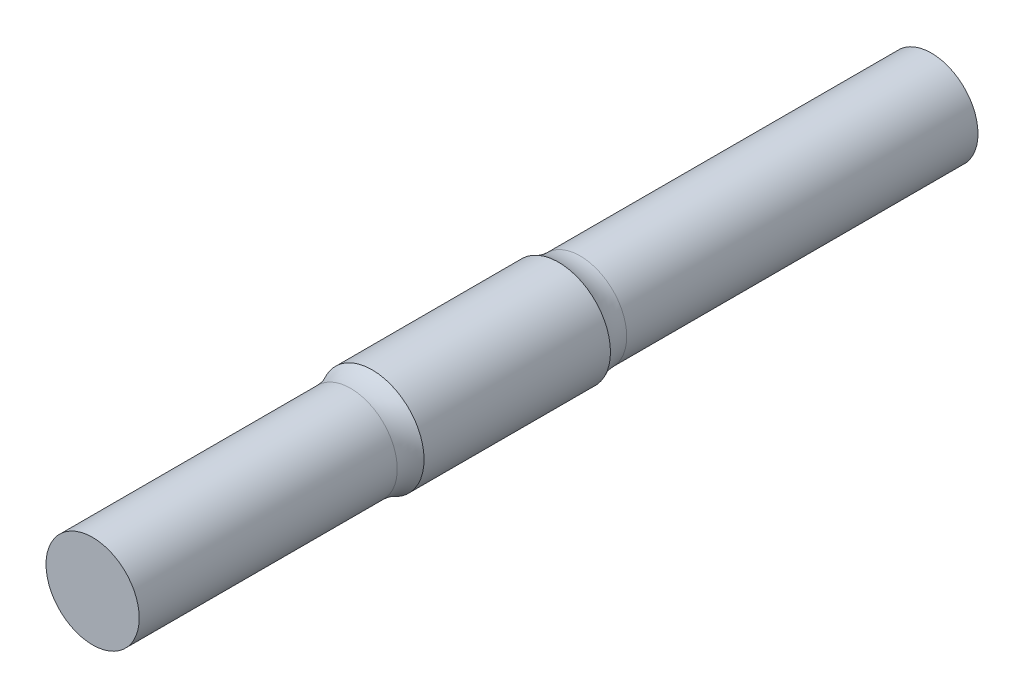
ISO-10303-21;
HEADER;
FILE_DESCRIPTION(('STEP AP214'),'2;1');
FILE_NAME('part.step','',(''),(''),'','','');
FILE_SCHEMA(('AUTOMOTIVE_DESIGN { 1 0 10303 214 1 1 1 1 }'));
ENDSEC;
DATA;
#1=APPLICATION_CONTEXT('core data for automotive mechanical design processes');
#2=APPLICATION_PROTOCOL_DEFINITION('international standard','automotive_design',2000,#1);
#3=PRODUCT_CONTEXT('',#1,'mechanical');
#4=PRODUCT('Part','Part','',(#3));
#5=PRODUCT_RELATED_PRODUCT_CATEGORY('part','',(#4));
#6=PRODUCT_DEFINITION_FORMATION('','',#4);
#7=PRODUCT_DEFINITION_CONTEXT('part definition',#1,'design');
#8=PRODUCT_DEFINITION('design','',#6,#7);
#9=PRODUCT_DEFINITION_SHAPE('','',#8);
#10=(LENGTH_UNIT() NAMED_UNIT(*) SI_UNIT(.MILLI.,.METRE.));
#11=(NAMED_UNIT(*) PLANE_ANGLE_UNIT() SI_UNIT($,.RADIAN.));
#12=(NAMED_UNIT(*) SI_UNIT($,.STERADIAN.) SOLID_ANGLE_UNIT());
#13=UNCERTAINTY_MEASURE_WITH_UNIT(LENGTH_MEASURE(1.E-05),#10,'distance_accuracy_value','');
#14=(GEOMETRIC_REPRESENTATION_CONTEXT(3) GLOBAL_UNCERTAINTY_ASSIGNED_CONTEXT((#13)) GLOBAL_UNIT_ASSIGNED_CONTEXT((#10,
#11,#12)) REPRESENTATION_CONTEXT('',''));
#15=CARTESIAN_POINT('',(0.,0.,0.));
#16=DIRECTION('',(0.,0.,1.));
#17=DIRECTION('',(1.,0.,0.));
#18=AXIS2_PLACEMENT_3D('',#15,#16,#17);
#19=CARTESIAN_POINT('',(0.,0.,10.));
#20=DIRECTION('',(0.,0.,-1.));
#21=DIRECTION('',(-1.,0.,0.));
#22=AXIS2_PLACEMENT_3D('',#19,#20,#21);
#23=CYLINDRICAL_SURFACE('',#22,5.565);
#24=CARTESIAN_POINT('',(0.,0.,10.));
#25=DIRECTION('',(0.,0.,1.));
#26=DIRECTION('',(1.,0.,0.));
#27=AXIS2_PLACEMENT_3D('',#24,#25,#26);
#28=CIRCLE('',#27,5.565);
#29=CARTESIAN_POINT('',(5.565,0.,10.));
#30=VERTEX_POINT('',#29);
#31=EDGE_CURVE('E42',#30,#30,#28,.T.);
#32=ORIENTED_EDGE('',*,*,#31,.F.);
#33=EDGE_LOOP('',(#32));
#34=FACE_BOUND('',#33,.T.);
#35=CARTESIAN_POINT('',(0.,0.,-10.));
#36=DIRECTION('',(0.,0.,1.));
#37=DIRECTION('',(1.,0.,0.));
#38=AXIS2_PLACEMENT_3D('',#35,#36,#37);
#39=CIRCLE('',#38,5.565);
#40=CARTESIAN_POINT('',(5.565,0.,-10.));
#41=VERTEX_POINT('',#40);
#42=EDGE_CURVE('E46',#41,#41,#39,.T.);
#43=ORIENTED_EDGE('',*,*,#42,.T.);
#44=EDGE_LOOP('',(#43));
#45=FACE_BOUND('',#44,.T.);
#46=ADVANCED_FACE('F31',(#34,#45),#23,.T.);
#47=CARTESIAN_POINT('',(0.,0.,40.));
#48=DIRECTION('',(0.,0.,-1.));
#49=DIRECTION('',(-1.,0.,0.));
#50=AXIS2_PLACEMENT_3D('',#47,#48,#49);
#51=CYLINDRICAL_SURFACE('',#50,5.);
#52=CARTESIAN_POINT('',(0.,0.,12.3088471149039));
#53=DIRECTION('',(0.,0.,-1.));
#54=DIRECTION('',(-1.,0.,0.));
#55=AXIS2_PLACEMENT_3D('',#52,#53,#54);
#56=CIRCLE('',#55,5.);
#57=CARTESIAN_POINT('',(-5.,0.,12.3088471149039));
#58=VERTEX_POINT('',#57);
#59=EDGE_CURVE('E38',#58,#58,#56,.F.);
#60=ORIENTED_EDGE('',*,*,#59,.T.);
#61=EDGE_LOOP('',(#60));
#62=FACE_BOUND('',#61,.T.);
#63=CARTESIAN_POINT('',(0.,0.,40.));
#64=DIRECTION('',(0.,0.,1.));
#65=DIRECTION('',(1.,0.,0.));
#66=AXIS2_PLACEMENT_3D('',#63,#64,#65);
#67=CIRCLE('',#66,5.);
#68=CARTESIAN_POINT('',(5.,0.,40.));
#69=VERTEX_POINT('',#68);
#70=EDGE_CURVE('E50',#69,#69,#67,.T.);
#71=ORIENTED_EDGE('',*,*,#70,.F.);
#72=EDGE_LOOP('',(#71));
#73=FACE_BOUND('',#72,.T.);
#74=ADVANCED_FACE('F70',(#62,#73),#51,.T.);
#75=CARTESIAN_POINT('',(0.,0.,40.));
#76=DIRECTION('',(0.,0.,1.));
#77=DIRECTION('',(1.,0.,0.));
#78=AXIS2_PLACEMENT_3D('',#75,#76,#77);
#79=PLANE('',#78);
#80=ORIENTED_EDGE('',*,*,#70,.T.);
#81=EDGE_LOOP('',(#80));
#82=FACE_BOUND('',#81,.T.);
#83=ADVANCED_FACE('F62',(#82),#79,.T.);
#84=CARTESIAN_POINT('',(0.,0.,-50.));
#85=DIRECTION('',(0.,0.,1.));
#86=DIRECTION('',(1.,0.,0.));
#87=AXIS2_PLACEMENT_3D('',#84,#85,#86);
#88=CYLINDRICAL_SURFACE('',#87,5.);
#89=CARTESIAN_POINT('',(0.,0.,-12.3088471149039));
#90=DIRECTION('',(0.,0.,1.));
#91=DIRECTION('',(1.,0.,0.));
#92=AXIS2_PLACEMENT_3D('',#89,#90,#91);
#93=CIRCLE('',#92,5.);
#94=CARTESIAN_POINT('',(5.,0.,-12.3088471149039));
#95=VERTEX_POINT('',#94);
#96=EDGE_CURVE('E10',#95,#95,#93,.F.);
#97=ORIENTED_EDGE('',*,*,#96,.T.);
#98=EDGE_LOOP('',(#97));
#99=FACE_BOUND('',#98,.T.);
#100=CARTESIAN_POINT('',(0.,0.,-50.));
#101=DIRECTION('',(0.,0.,-1.));
#102=DIRECTION('',(-1.,0.,0.));
#103=AXIS2_PLACEMENT_3D('',#100,#101,#102);
#104=CIRCLE('',#103,5.);
#105=CARTESIAN_POINT('',(-5.,0.,-50.));
#106=VERTEX_POINT('',#105);
#107=EDGE_CURVE('E54',#106,#106,#104,.T.);
#108=ORIENTED_EDGE('',*,*,#107,.F.);
#109=EDGE_LOOP('',(#108));
#110=FACE_BOUND('',#109,.T.);
#111=ADVANCED_FACE('F60',(#99,#110),#88,.T.);
#112=CARTESIAN_POINT('',(0.,0.,-50.));
#113=DIRECTION('',(0.,0.,-1.));
#114=DIRECTION('',(-1.,0.,0.));
#115=AXIS2_PLACEMENT_3D('',#112,#113,#114);
#116=PLANE('',#115);
#117=ORIENTED_EDGE('',*,*,#107,.T.);
#118=EDGE_LOOP('',(#117));
#119=FACE_BOUND('',#118,.T.);
#120=ADVANCED_FACE('F58',(#119),#116,.T.);
#121=CARTESIAN_POINT('',(0.,0.,12.3088471149039));
#122=DIRECTION('',(0.,0.,-1.));
#123=DIRECTION('',(-1.,0.,0.));
#124=AXIS2_PLACEMENT_3D('',#121,#122,#123);
#125=TOROIDAL_SURFACE('',#124,10.,5.);
#126=ORIENTED_EDGE('',*,*,#31,.T.);
#127=EDGE_LOOP('',(#126));
#128=FACE_BOUND('',#127,.T.);
#129=ORIENTED_EDGE('',*,*,#59,.F.);
#130=EDGE_LOOP('',(#129));
#131=FACE_BOUND('',#130,.T.);
#132=ADVANCED_FACE('F68',(#128,#131),#125,.F.);
#133=CARTESIAN_POINT('',(0.,0.,-12.3088471149039));
#134=DIRECTION('',(0.,0.,1.));
#135=DIRECTION('',(1.,0.,0.));
#136=AXIS2_PLACEMENT_3D('',#133,#134,#135);
#137=TOROIDAL_SURFACE('',#136,10.,5.);
#138=ORIENTED_EDGE('',*,*,#42,.F.);
#139=EDGE_LOOP('',(#138));
#140=FACE_BOUND('',#139,.T.);
#141=ORIENTED_EDGE('',*,*,#96,.F.);
#142=EDGE_LOOP('',(#141));
#143=FACE_BOUND('',#142,.T.);
#144=ADVANCED_FACE('F33',(#140,#143),#137,.F.);
#145=CLOSED_SHELL('',(#46,#74,#83,#111,#120,#132,#144));
#146=MANIFOLD_SOLID_BREP('B2',#145);
#147=ADVANCED_BREP_SHAPE_REPRESENTATION('',(#18,#146),#14);
#148=SHAPE_DEFINITION_REPRESENTATION(#9,#147);
ENDSEC;
END-ISO-10303-21;
